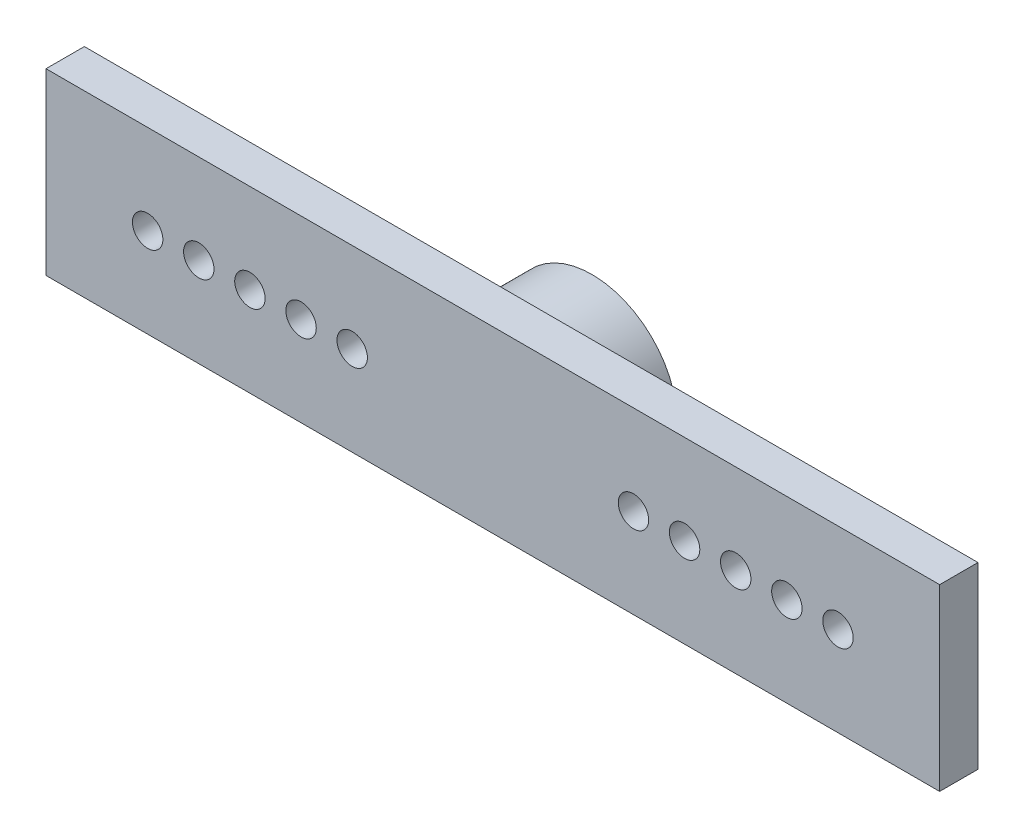
ISO-10303-21;
HEADER;
FILE_DESCRIPTION(('STEP AP214'),'2;1');
FILE_NAME('part.step','',(''),(''),'','','');
FILE_SCHEMA(('AUTOMOTIVE_DESIGN { 1 0 10303 214 1 1 1 1 }'));
ENDSEC;
DATA;
#1=APPLICATION_CONTEXT('core data for automotive mechanical design processes');
#2=APPLICATION_PROTOCOL_DEFINITION('international standard','automotive_design',2000,#1);
#3=PRODUCT_CONTEXT('',#1,'mechanical');
#4=PRODUCT('Part','Part','',(#3));
#5=PRODUCT_RELATED_PRODUCT_CATEGORY('part','',(#4));
#6=PRODUCT_DEFINITION_FORMATION('','',#4);
#7=PRODUCT_DEFINITION_CONTEXT('part definition',#1,'design');
#8=PRODUCT_DEFINITION('design','',#6,#7);
#9=PRODUCT_DEFINITION_SHAPE('','',#8);
#10=(LENGTH_UNIT() NAMED_UNIT(*) SI_UNIT(.MILLI.,.METRE.));
#11=(NAMED_UNIT(*) PLANE_ANGLE_UNIT() SI_UNIT($,.RADIAN.));
#12=(NAMED_UNIT(*) SI_UNIT($,.STERADIAN.) SOLID_ANGLE_UNIT());
#13=UNCERTAINTY_MEASURE_WITH_UNIT(LENGTH_MEASURE(1.E-05),#10,'distance_accuracy_value','');
#14=(GEOMETRIC_REPRESENTATION_CONTEXT(3) GLOBAL_UNCERTAINTY_ASSIGNED_CONTEXT((#13)) GLOBAL_UNIT_ASSIGNED_CONTEXT((#10,
#11,#12)) REPRESENTATION_CONTEXT('',''));
#15=CARTESIAN_POINT('',(0.,0.,0.));
#16=DIRECTION('',(0.,0.,1.));
#17=DIRECTION('',(1.,0.,0.));
#18=AXIS2_PLACEMENT_3D('',#15,#16,#17);
#19=CARTESIAN_POINT('',(22.1938363345951,4.44784573033217,0.));
#20=DIRECTION('',(0.,0.,-1.));
#21=DIRECTION('',(-1.,0.,0.));
#22=AXIS2_PLACEMENT_3D('',#19,#20,#21);
#23=PLANE('',#22);
#24=CARTESIAN_POINT('',(-17.145,-1.19722964452441E-13,0.));
#25=DIRECTION('',(0.,0.,-1.));
#26=DIRECTION('',(-1.,0.,0.));
#27=AXIS2_PLACEMENT_3D('',#24,#25,#26);
#28=CIRCLE('',#27,0.75565);
#29=CARTESIAN_POINT('',(-17.90065,-1.19722964452441E-13,0.));
#30=VERTEX_POINT('',#29);
#31=EDGE_CURVE('E184',#30,#30,#28,.T.);
#32=ORIENTED_EDGE('',*,*,#31,.F.);
#33=EDGE_LOOP('',(#32));
#34=FACE_BOUND('',#33,.T.);
#35=CARTESIAN_POINT('',(-14.605,-1.01986228978005E-13,0.));
#36=DIRECTION('',(0.,0.,-1.));
#37=DIRECTION('',(-1.,0.,0.));
#38=AXIS2_PLACEMENT_3D('',#35,#36,#37);
#39=CIRCLE('',#38,0.755649999999999);
#40=CARTESIAN_POINT('',(-15.36065,-1.01986228978005E-13,0.));
#41=VERTEX_POINT('',#40);
#42=EDGE_CURVE('E178',#41,#41,#39,.T.);
#43=ORIENTED_EDGE('',*,*,#42,.F.);
#44=EDGE_LOOP('',(#43));
#45=FACE_BOUND('',#44,.T.);
#46=CARTESIAN_POINT('',(-12.065,0.,0.));
#47=DIRECTION('',(0.,0.,-1.));
#48=DIRECTION('',(-1.,0.,0.));
#49=AXIS2_PLACEMENT_3D('',#46,#47,#48);
#50=CIRCLE('',#49,0.755649999999999);
#51=CARTESIAN_POINT('',(-12.82065,0.,0.));
#52=VERTEX_POINT('',#51);
#53=EDGE_CURVE('E172',#52,#52,#50,.T.);
#54=ORIENTED_EDGE('',*,*,#53,.F.);
#55=EDGE_LOOP('',(#54));
#56=FACE_BOUND('',#55,.T.);
#57=CARTESIAN_POINT('',(-9.525,0.,0.));
#58=DIRECTION('',(0.,0.,-1.));
#59=DIRECTION('',(-1.,0.,0.));
#60=AXIS2_PLACEMENT_3D('',#57,#58,#59);
#61=CIRCLE('',#60,0.755649999999999);
#62=CARTESIAN_POINT('',(-10.28065,0.,0.));
#63=VERTEX_POINT('',#62);
#64=EDGE_CURVE('E166',#63,#63,#61,.T.);
#65=ORIENTED_EDGE('',*,*,#64,.F.);
#66=EDGE_LOOP('',(#65));
#67=FACE_BOUND('',#66,.T.);
#68=CARTESIAN_POINT('',(-6.985,0.,0.));
#69=DIRECTION('',(0.,0.,-1.));
#70=DIRECTION('',(-1.,0.,0.));
#71=AXIS2_PLACEMENT_3D('',#68,#69,#70);
#72=CIRCLE('',#71,0.755649999999999);
#73=CARTESIAN_POINT('',(-7.74065,0.,0.));
#74=VERTEX_POINT('',#73);
#75=EDGE_CURVE('E160',#74,#74,#72,.T.);
#76=ORIENTED_EDGE('',*,*,#75,.F.);
#77=EDGE_LOOP('',(#76));
#78=FACE_BOUND('',#77,.T.);
#79=CARTESIAN_POINT('',(17.145,0.,0.));
#80=DIRECTION('',(0.,0.,-1.));
#81=DIRECTION('',(-1.,0.,0.));
#82=AXIS2_PLACEMENT_3D('',#79,#80,#81);
#83=CIRCLE('',#82,0.75565);
#84=CARTESIAN_POINT('',(16.38935,0.,0.));
#85=VERTEX_POINT('',#84);
#86=EDGE_CURVE('E154',#85,#85,#83,.T.);
#87=ORIENTED_EDGE('',*,*,#86,.F.);
#88=EDGE_LOOP('',(#87));
#89=FACE_BOUND('',#88,.T.);
#90=CARTESIAN_POINT('',(14.605,0.,0.));
#91=DIRECTION('',(0.,0.,-1.));
#92=DIRECTION('',(-1.,0.,0.));
#93=AXIS2_PLACEMENT_3D('',#90,#91,#92);
#94=CIRCLE('',#93,0.755649999999999);
#95=CARTESIAN_POINT('',(13.84935,0.,0.));
#96=VERTEX_POINT('',#95);
#97=EDGE_CURVE('E148',#96,#96,#94,.T.);
#98=ORIENTED_EDGE('',*,*,#97,.F.);
#99=EDGE_LOOP('',(#98));
#100=FACE_BOUND('',#99,.T.);
#101=CARTESIAN_POINT('',(12.065,0.,0.));
#102=DIRECTION('',(0.,0.,-1.));
#103=DIRECTION('',(-1.,0.,0.));
#104=AXIS2_PLACEMENT_3D('',#101,#102,#103);
#105=CIRCLE('',#104,0.755649999999999);
#106=CARTESIAN_POINT('',(11.30935,0.,0.));
#107=VERTEX_POINT('',#106);
#108=EDGE_CURVE('E142',#107,#107,#105,.T.);
#109=ORIENTED_EDGE('',*,*,#108,.F.);
#110=EDGE_LOOP('',(#109));
#111=FACE_BOUND('',#110,.T.);
#112=CARTESIAN_POINT('',(9.525,0.,0.));
#113=DIRECTION('',(0.,0.,-1.));
#114=DIRECTION('',(-1.,0.,0.));
#115=AXIS2_PLACEMENT_3D('',#112,#113,#114);
#116=CIRCLE('',#115,0.755649999999999);
#117=CARTESIAN_POINT('',(8.76935,0.,0.));
#118=VERTEX_POINT('',#117);
#119=EDGE_CURVE('E136',#118,#118,#116,.T.);
#120=ORIENTED_EDGE('',*,*,#119,.F.);
#121=EDGE_LOOP('',(#120));
#122=FACE_BOUND('',#121,.T.);
#123=CARTESIAN_POINT('',(6.985,0.,0.));
#124=DIRECTION('',(0.,0.,-1.));
#125=DIRECTION('',(-1.,0.,0.));
#126=AXIS2_PLACEMENT_3D('',#123,#124,#125);
#127=CIRCLE('',#126,0.755649999999999);
#128=CARTESIAN_POINT('',(6.22935,0.,0.));
#129=VERTEX_POINT('',#128);
#130=EDGE_CURVE('E41',#129,#129,#127,.T.);
#131=ORIENTED_EDGE('',*,*,#130,.F.);
#132=EDGE_LOOP('',(#131));
#133=FACE_BOUND('',#132,.T.);
#134=DIRECTION('',(0.,1.,0.));
#135=VECTOR('',#134,1.);
#136=CARTESIAN_POINT('',(22.1938363345951,-4.44784573033217,0.));
#137=LINE('',#136,#135);
#138=CARTESIAN_POINT('',(22.1938363345951,-4.44784573033217,0.));
#139=VERTEX_POINT('',#138);
#140=CARTESIAN_POINT('',(22.1938363345951,4.44784573033217,0.));
#141=VERTEX_POINT('',#140);
#142=EDGE_CURVE('E105',#139,#141,#137,.T.);
#143=ORIENTED_EDGE('',*,*,#142,.F.);
#144=DIRECTION('',(1.,0.,0.));
#145=VECTOR('',#144,1.);
#146=CARTESIAN_POINT('',(-22.1938363345951,-4.44784573033217,0.));
#147=LINE('',#146,#145);
#148=CARTESIAN_POINT('',(-22.1938363345951,-4.44784573033217,0.));
#149=VERTEX_POINT('',#148);
#150=EDGE_CURVE('E78',#149,#139,#147,.T.);
#151=ORIENTED_EDGE('',*,*,#150,.F.);
#152=DIRECTION('',(0.,-1.,0.));
#153=VECTOR('',#152,1.);
#154=CARTESIAN_POINT('',(-22.1938363345951,-4.44784573033217,0.));
#155=LINE('',#154,#153);
#156=CARTESIAN_POINT('',(-22.1938363345951,4.44784573033217,0.));
#157=VERTEX_POINT('',#156);
#158=EDGE_CURVE('E72',#157,#149,#155,.T.);
#159=ORIENTED_EDGE('',*,*,#158,.F.);
#160=DIRECTION('',(-1.,0.,0.));
#161=VECTOR('',#160,1.);
#162=CARTESIAN_POINT('',(-22.1938363345951,4.44784573033217,0.));
#163=LINE('',#162,#161);
#164=EDGE_CURVE('E96',#141,#157,#163,.T.);
#165=ORIENTED_EDGE('',*,*,#164,.F.);
#166=EDGE_LOOP('',(#143,#151,#159,#165));
#167=FACE_BOUND('',#166,.T.);
#168=CARTESIAN_POINT('',(0.,0.,0.));
#169=DIRECTION('',(0.,0.,-1.));
#170=DIRECTION('',(-1.,0.,0.));
#171=AXIS2_PLACEMENT_3D('',#168,#169,#170);
#172=CIRCLE('',#171,4.2291);
#173=CARTESIAN_POINT('',(-4.2291,0.,0.));
#174=VERTEX_POINT('',#173);
#175=EDGE_CURVE('E124',#174,#174,#172,.T.);
#176=ORIENTED_EDGE('',*,*,#175,.F.);
#177=EDGE_LOOP('',(#176));
#178=FACE_BOUND('',#177,.T.);
#179=ADVANCED_FACE('F37',(#34,#45,#56,#67,#78,#89,#100,#111,#122,#133,#167,#178),#23,.T.);
#180=CARTESIAN_POINT('',(22.1938363345951,-4.44784573033217,1.905));
#181=DIRECTION('',(-1.,0.,0.));
#182=DIRECTION('',(0.,0.,1.));
#183=AXIS2_PLACEMENT_3D('',#180,#181,#182);
#184=PLANE('',#183);
#185=ORIENTED_EDGE('',*,*,#142,.T.);
#186=DIRECTION('',(0.,0.,-1.));
#187=VECTOR('',#186,1.);
#188=CARTESIAN_POINT('',(22.1938363345951,4.44784573033217,1.905));
#189=LINE('',#188,#187);
#190=CARTESIAN_POINT('',(22.1938363345951,4.44784573033217,1.905));
#191=VERTEX_POINT('',#190);
#192=EDGE_CURVE('E47',#191,#141,#189,.T.);
#193=ORIENTED_EDGE('',*,*,#192,.F.);
#194=DIRECTION('',(0.,1.,0.));
#195=VECTOR('',#194,1.);
#196=CARTESIAN_POINT('',(22.1938363345951,-4.44784573033217,1.905));
#197=LINE('',#196,#195);
#198=CARTESIAN_POINT('',(22.1938363345951,-4.44784573033217,1.905));
#199=VERTEX_POINT('',#198);
#200=EDGE_CURVE('E91',#199,#191,#197,.T.);
#201=ORIENTED_EDGE('',*,*,#200,.F.);
#202=DIRECTION('',(0.,0.,-1.));
#203=VECTOR('',#202,1.);
#204=CARTESIAN_POINT('',(22.1938363345951,-4.44784573033217,1.905));
#205=LINE('',#204,#203);
#206=EDGE_CURVE('E101',#199,#139,#205,.T.);
#207=ORIENTED_EDGE('',*,*,#206,.T.);
#208=EDGE_LOOP('',(#185,#193,#201,#207));
#209=FACE_BOUND('',#208,.T.);
#210=ADVANCED_FACE('F39',(#209),#184,.F.);
#211=CARTESIAN_POINT('',(-22.1938363345951,4.44784573033217,1.905));
#212=DIRECTION('',(0.,-1.,0.));
#213=DIRECTION('',(0.,0.,-1.));
#214=AXIS2_PLACEMENT_3D('',#211,#212,#213);
#215=PLANE('',#214);
#216=ORIENTED_EDGE('',*,*,#164,.T.);
#217=DIRECTION('',(0.,0.,-1.));
#218=VECTOR('',#217,1.);
#219=CARTESIAN_POINT('',(-22.1938363345951,4.44784573033217,1.905));
#220=LINE('',#219,#218);
#221=CARTESIAN_POINT('',(-22.1938363345951,4.44784573033217,1.905));
#222=VERTEX_POINT('',#221);
#223=EDGE_CURVE('E94',#222,#157,#220,.T.);
#224=ORIENTED_EDGE('',*,*,#223,.F.);
#225=DIRECTION('',(-1.,0.,0.));
#226=VECTOR('',#225,1.);
#227=CARTESIAN_POINT('',(-22.1938363345951,4.44784573033217,1.905));
#228=LINE('',#227,#226);
#229=EDGE_CURVE('E86',#191,#222,#228,.T.);
#230=ORIENTED_EDGE('',*,*,#229,.F.);
#231=ORIENTED_EDGE('',*,*,#192,.T.);
#232=EDGE_LOOP('',(#216,#224,#230,#231));
#233=FACE_BOUND('',#232,.T.);
#234=ADVANCED_FACE('F95',(#233),#215,.F.);
#235=CARTESIAN_POINT('',(-22.1938363345951,-4.44784573033217,1.905));
#236=DIRECTION('',(1.,0.,0.));
#237=DIRECTION('',(0.,0.,-1.));
#238=AXIS2_PLACEMENT_3D('',#235,#236,#237);
#239=PLANE('',#238);
#240=ORIENTED_EDGE('',*,*,#158,.T.);
#241=DIRECTION('',(0.,0.,-1.));
#242=VECTOR('',#241,1.);
#243=CARTESIAN_POINT('',(-22.1938363345951,-4.44784573033217,1.905));
#244=LINE('',#243,#242);
#245=CARTESIAN_POINT('',(-22.1938363345951,-4.44784573033217,1.905));
#246=VERTEX_POINT('',#245);
#247=EDGE_CURVE('E97',#246,#149,#244,.T.);
#248=ORIENTED_EDGE('',*,*,#247,.F.);
#249=DIRECTION('',(0.,-1.,0.));
#250=VECTOR('',#249,1.);
#251=CARTESIAN_POINT('',(-22.1938363345951,-4.44784573033217,1.905));
#252=LINE('',#251,#250);
#253=EDGE_CURVE('E89',#222,#246,#252,.T.);
#254=ORIENTED_EDGE('',*,*,#253,.F.);
#255=ORIENTED_EDGE('',*,*,#223,.T.);
#256=EDGE_LOOP('',(#240,#248,#254,#255));
#257=FACE_BOUND('',#256,.T.);
#258=ADVANCED_FACE('F99',(#257),#239,.F.);
#259=CARTESIAN_POINT('',(-22.1938363345951,-4.44784573033217,1.905));
#260=DIRECTION('',(0.,1.,0.));
#261=DIRECTION('',(0.,0.,1.));
#262=AXIS2_PLACEMENT_3D('',#259,#260,#261);
#263=PLANE('',#262);
#264=ORIENTED_EDGE('',*,*,#150,.T.);
#265=ORIENTED_EDGE('',*,*,#206,.F.);
#266=DIRECTION('',(1.,0.,0.));
#267=VECTOR('',#266,1.);
#268=CARTESIAN_POINT('',(-22.1938363345951,-4.44784573033217,1.905));
#269=LINE('',#268,#267);
#270=EDGE_CURVE('E55',#246,#199,#269,.T.);
#271=ORIENTED_EDGE('',*,*,#270,.F.);
#272=ORIENTED_EDGE('',*,*,#247,.T.);
#273=EDGE_LOOP('',(#264,#265,#271,#272));
#274=FACE_BOUND('',#273,.T.);
#275=ADVANCED_FACE('F196',(#274),#263,.F.);
#276=CARTESIAN_POINT('',(22.1938363345951,4.44784573033217,1.905));
#277=DIRECTION('',(0.,0.,-1.));
#278=DIRECTION('',(-1.,0.,0.));
#279=AXIS2_PLACEMENT_3D('',#276,#277,#278);
#280=PLANE('',#279);
#281=CARTESIAN_POINT('',(-17.145,-1.19722964452441E-13,1.905));
#282=DIRECTION('',(0.,0.,1.));
#283=DIRECTION('',(1.,0.,0.));
#284=AXIS2_PLACEMENT_3D('',#281,#282,#283);
#285=CIRCLE('',#284,0.75565);
#286=CARTESIAN_POINT('',(-16.38935,-1.19722964452441E-13,1.905));
#287=VERTEX_POINT('',#286);
#288=EDGE_CURVE('E187',#287,#287,#285,.T.);
#289=ORIENTED_EDGE('',*,*,#288,.F.);
#290=EDGE_LOOP('',(#289));
#291=FACE_BOUND('',#290,.T.);
#292=CARTESIAN_POINT('',(-14.605,-1.01986228978005E-13,1.905));
#293=DIRECTION('',(0.,0.,1.));
#294=DIRECTION('',(1.,0.,0.));
#295=AXIS2_PLACEMENT_3D('',#292,#293,#294);
#296=CIRCLE('',#295,0.75565);
#297=CARTESIAN_POINT('',(-13.84935,-1.01986228978005E-13,1.905));
#298=VERTEX_POINT('',#297);
#299=EDGE_CURVE('E181',#298,#298,#296,.T.);
#300=ORIENTED_EDGE('',*,*,#299,.F.);
#301=EDGE_LOOP('',(#300));
#302=FACE_BOUND('',#301,.T.);
#303=CARTESIAN_POINT('',(-12.065,0.,1.905));
#304=DIRECTION('',(0.,0.,1.));
#305=DIRECTION('',(1.,0.,0.));
#306=AXIS2_PLACEMENT_3D('',#303,#304,#305);
#307=CIRCLE('',#306,0.75565);
#308=CARTESIAN_POINT('',(-11.30935,0.,1.905));
#309=VERTEX_POINT('',#308);
#310=EDGE_CURVE('E175',#309,#309,#307,.T.);
#311=ORIENTED_EDGE('',*,*,#310,.F.);
#312=EDGE_LOOP('',(#311));
#313=FACE_BOUND('',#312,.T.);
#314=CARTESIAN_POINT('',(-9.525,0.,1.905));
#315=DIRECTION('',(0.,0.,1.));
#316=DIRECTION('',(1.,0.,0.));
#317=AXIS2_PLACEMENT_3D('',#314,#315,#316);
#318=CIRCLE('',#317,0.75565);
#319=CARTESIAN_POINT('',(-8.76935,0.,1.905));
#320=VERTEX_POINT('',#319);
#321=EDGE_CURVE('E169',#320,#320,#318,.T.);
#322=ORIENTED_EDGE('',*,*,#321,.F.);
#323=EDGE_LOOP('',(#322));
#324=FACE_BOUND('',#323,.T.);
#325=CARTESIAN_POINT('',(-6.985,0.,1.905));
#326=DIRECTION('',(0.,0.,1.));
#327=DIRECTION('',(1.,0.,0.));
#328=AXIS2_PLACEMENT_3D('',#325,#326,#327);
#329=CIRCLE('',#328,0.755649999999999);
#330=CARTESIAN_POINT('',(-6.22935,0.,1.905));
#331=VERTEX_POINT('',#330);
#332=EDGE_CURVE('E163',#331,#331,#329,.T.);
#333=ORIENTED_EDGE('',*,*,#332,.F.);
#334=EDGE_LOOP('',(#333));
#335=FACE_BOUND('',#334,.T.);
#336=CARTESIAN_POINT('',(17.145,0.,1.905));
#337=DIRECTION('',(0.,0.,1.));
#338=DIRECTION('',(1.,0.,0.));
#339=AXIS2_PLACEMENT_3D('',#336,#337,#338);
#340=CIRCLE('',#339,0.75565);
#341=CARTESIAN_POINT('',(17.90065,0.,1.905));
#342=VERTEX_POINT('',#341);
#343=EDGE_CURVE('E157',#342,#342,#340,.T.);
#344=ORIENTED_EDGE('',*,*,#343,.F.);
#345=EDGE_LOOP('',(#344));
#346=FACE_BOUND('',#345,.T.);
#347=CARTESIAN_POINT('',(14.605,0.,1.905));
#348=DIRECTION('',(0.,0.,1.));
#349=DIRECTION('',(1.,0.,0.));
#350=AXIS2_PLACEMENT_3D('',#347,#348,#349);
#351=CIRCLE('',#350,0.75565);
#352=CARTESIAN_POINT('',(15.36065,0.,1.905));
#353=VERTEX_POINT('',#352);
#354=EDGE_CURVE('E151',#353,#353,#351,.T.);
#355=ORIENTED_EDGE('',*,*,#354,.F.);
#356=EDGE_LOOP('',(#355));
#357=FACE_BOUND('',#356,.T.);
#358=CARTESIAN_POINT('',(12.065,0.,1.905));
#359=DIRECTION('',(0.,0.,1.));
#360=DIRECTION('',(1.,0.,0.));
#361=AXIS2_PLACEMENT_3D('',#358,#359,#360);
#362=CIRCLE('',#361,0.75565);
#363=CARTESIAN_POINT('',(12.82065,0.,1.905));
#364=VERTEX_POINT('',#363);
#365=EDGE_CURVE('E145',#364,#364,#362,.T.);
#366=ORIENTED_EDGE('',*,*,#365,.F.);
#367=EDGE_LOOP('',(#366));
#368=FACE_BOUND('',#367,.T.);
#369=CARTESIAN_POINT('',(9.525,0.,1.905));
#370=DIRECTION('',(0.,0.,1.));
#371=DIRECTION('',(1.,0.,0.));
#372=AXIS2_PLACEMENT_3D('',#369,#370,#371);
#373=CIRCLE('',#372,0.75565);
#374=CARTESIAN_POINT('',(10.28065,0.,1.905));
#375=VERTEX_POINT('',#374);
#376=EDGE_CURVE('E139',#375,#375,#373,.T.);
#377=ORIENTED_EDGE('',*,*,#376,.F.);
#378=EDGE_LOOP('',(#377));
#379=FACE_BOUND('',#378,.T.);
#380=CARTESIAN_POINT('',(6.985,0.,1.905));
#381=DIRECTION('',(0.,0.,1.));
#382=DIRECTION('',(1.,0.,0.));
#383=AXIS2_PLACEMENT_3D('',#380,#381,#382);
#384=CIRCLE('',#383,0.755649999999999);
#385=CARTESIAN_POINT('',(7.74065,0.,1.905));
#386=VERTEX_POINT('',#385);
#387=EDGE_CURVE('E133',#386,#386,#384,.T.);
#388=ORIENTED_EDGE('',*,*,#387,.F.);
#389=EDGE_LOOP('',(#388));
#390=FACE_BOUND('',#389,.T.);
#391=ORIENTED_EDGE('',*,*,#200,.T.);
#392=ORIENTED_EDGE('',*,*,#229,.T.);
#393=ORIENTED_EDGE('',*,*,#253,.T.);
#394=ORIENTED_EDGE('',*,*,#270,.T.);
#395=EDGE_LOOP('',(#391,#392,#393,#394));
#396=FACE_BOUND('',#395,.T.);
#397=ADVANCED_FACE('F87',(#291,#302,#313,#324,#335,#346,#357,#368,#379,#390,#396),#280,.F.);
#398=CARTESIAN_POINT('',(0.,0.,-3.0226));
#399=DIRECTION('',(0.,0.,-1.));
#400=DIRECTION('',(-1.,0.,0.));
#401=AXIS2_PLACEMENT_3D('',#398,#399,#400);
#402=PLANE('',#401);
#403=CARTESIAN_POINT('',(0.,0.,-3.0226));
#404=DIRECTION('',(0.,0.,-1.));
#405=DIRECTION('',(-1.,0.,0.));
#406=AXIS2_PLACEMENT_3D('',#403,#404,#405);
#407=CIRCLE('',#406,4.2291);
#408=CARTESIAN_POINT('',(-4.2291,0.,-3.0226));
#409=VERTEX_POINT('',#408);
#410=EDGE_CURVE('E108',#409,#409,#407,.T.);
#411=ORIENTED_EDGE('',*,*,#410,.T.);
#412=EDGE_LOOP('',(#411));
#413=FACE_BOUND('',#412,.T.);
#414=CARTESIAN_POINT('',(0.,0.,-3.0226));
#415=DIRECTION('',(0.,0.,-1.));
#416=DIRECTION('',(-1.,0.,0.));
#417=AXIS2_PLACEMENT_3D('',#414,#415,#416);
#418=CIRCLE('',#417,2.9718);
#419=CARTESIAN_POINT('',(-2.9718,0.,-3.0226));
#420=VERTEX_POINT('',#419);
#421=EDGE_CURVE('E126',#420,#420,#418,.T.);
#422=ORIENTED_EDGE('',*,*,#421,.F.);
#423=EDGE_LOOP('',(#422));
#424=FACE_BOUND('',#423,.T.);
#425=ADVANCED_FACE('F195',(#413,#424),#402,.T.);
#426=CARTESIAN_POINT('',(0.,0.,-3.0226));
#427=DIRECTION('',(0.,0.,1.));
#428=DIRECTION('',(1.,0.,0.));
#429=AXIS2_PLACEMENT_3D('',#426,#427,#428);
#430=CYLINDRICAL_SURFACE('',#429,4.2291);
#431=ORIENTED_EDGE('',*,*,#410,.F.);
#432=EDGE_LOOP('',(#431));
#433=FACE_BOUND('',#432,.T.);
#434=ORIENTED_EDGE('',*,*,#175,.T.);
#435=EDGE_LOOP('',(#434));
#436=FACE_BOUND('',#435,.T.);
#437=ADVANCED_FACE('F235',(#433,#436),#430,.T.);
#438=CARTESIAN_POINT('',(0.,0.,-3.0226));
#439=DIRECTION('',(0.,0.,1.));
#440=DIRECTION('',(1.,0.,0.));
#441=AXIS2_PLACEMENT_3D('',#438,#439,#440);
#442=CYLINDRICAL_SURFACE('',#441,2.9718);
#443=ORIENTED_EDGE('',*,*,#421,.T.);
#444=EDGE_LOOP('',(#443));
#445=FACE_BOUND('',#444,.T.);
#446=CARTESIAN_POINT('',(0.,0.,0.));
#447=DIRECTION('',(0.,0.,-1.));
#448=DIRECTION('',(-1.,0.,0.));
#449=AXIS2_PLACEMENT_3D('',#446,#447,#448);
#450=CIRCLE('',#449,2.9718);
#451=CARTESIAN_POINT('',(-2.9718,0.,0.));
#452=VERTEX_POINT('',#451);
#453=EDGE_CURVE('E11',#452,#452,#450,.F.);
#454=ORIENTED_EDGE('',*,*,#453,.T.);
#455=EDGE_LOOP('',(#454));
#456=FACE_BOUND('',#455,.T.);
#457=ADVANCED_FACE('F228',(#445,#456),#442,.F.);
#458=ORIENTED_EDGE('',*,*,#453,.F.);
#459=EDGE_LOOP('',(#458));
#460=FACE_BOUND('',#459,.T.);
#461=ADVANCED_FACE('F121',(#460),#23,.T.);
#462=CARTESIAN_POINT('',(6.985,0.,1.905));
#463=DIRECTION('',(0.,0.,1.));
#464=DIRECTION('',(1.,0.,0.));
#465=AXIS2_PLACEMENT_3D('',#462,#463,#464);
#466=CYLINDRICAL_SURFACE('',#465,0.755649999999999);
#467=ORIENTED_EDGE('',*,*,#130,.T.);
#468=EDGE_LOOP('',(#467));
#469=FACE_BOUND('',#468,.T.);
#470=ORIENTED_EDGE('',*,*,#387,.T.);
#471=EDGE_LOOP('',(#470));
#472=FACE_BOUND('',#471,.T.);
#473=ADVANCED_FACE('F216',(#469,#472),#466,.F.);
#474=CARTESIAN_POINT('',(9.525,0.,1.905));
#475=DIRECTION('',(0.,0.,1.));
#476=DIRECTION('',(1.,0.,0.));
#477=AXIS2_PLACEMENT_3D('',#474,#475,#476);
#478=CYLINDRICAL_SURFACE('',#477,0.755649999999999);
#479=ORIENTED_EDGE('',*,*,#119,.T.);
#480=EDGE_LOOP('',(#479));
#481=FACE_BOUND('',#480,.T.);
#482=ORIENTED_EDGE('',*,*,#376,.T.);
#483=EDGE_LOOP('',(#482));
#484=FACE_BOUND('',#483,.T.);
#485=ADVANCED_FACE('F218',(#481,#484),#478,.F.);
#486=CARTESIAN_POINT('',(12.065,0.,1.905));
#487=DIRECTION('',(0.,0.,1.));
#488=DIRECTION('',(1.,0.,0.));
#489=AXIS2_PLACEMENT_3D('',#486,#487,#488);
#490=CYLINDRICAL_SURFACE('',#489,0.755649999999999);
#491=ORIENTED_EDGE('',*,*,#108,.T.);
#492=EDGE_LOOP('',(#491));
#493=FACE_BOUND('',#492,.T.);
#494=ORIENTED_EDGE('',*,*,#365,.T.);
#495=EDGE_LOOP('',(#494));
#496=FACE_BOUND('',#495,.T.);
#497=ADVANCED_FACE('F225',(#493,#496),#490,.F.);
#498=CARTESIAN_POINT('',(14.605,0.,1.905));
#499=DIRECTION('',(0.,0.,1.));
#500=DIRECTION('',(1.,0.,0.));
#501=AXIS2_PLACEMENT_3D('',#498,#499,#500);
#502=CYLINDRICAL_SURFACE('',#501,0.755649999999999);
#503=ORIENTED_EDGE('',*,*,#97,.T.);
#504=EDGE_LOOP('',(#503));
#505=FACE_BOUND('',#504,.T.);
#506=ORIENTED_EDGE('',*,*,#354,.T.);
#507=EDGE_LOOP('',(#506));
#508=FACE_BOUND('',#507,.T.);
#509=ADVANCED_FACE('F326',(#505,#508),#502,.F.);
#510=CARTESIAN_POINT('',(17.145,0.,1.905));
#511=DIRECTION('',(0.,0.,1.));
#512=DIRECTION('',(1.,0.,0.));
#513=AXIS2_PLACEMENT_3D('',#510,#511,#512);
#514=CYLINDRICAL_SURFACE('',#513,0.75565);
#515=ORIENTED_EDGE('',*,*,#86,.T.);
#516=EDGE_LOOP('',(#515));
#517=FACE_BOUND('',#516,.T.);
#518=ORIENTED_EDGE('',*,*,#343,.T.);
#519=EDGE_LOOP('',(#518));
#520=FACE_BOUND('',#519,.T.);
#521=ADVANCED_FACE('F264',(#517,#520),#514,.F.);
#522=CARTESIAN_POINT('',(-6.985,0.,1.905));
#523=DIRECTION('',(0.,0.,1.));
#524=DIRECTION('',(1.,0.,0.));
#525=AXIS2_PLACEMENT_3D('',#522,#523,#524);
#526=CYLINDRICAL_SURFACE('',#525,0.755649999999999);
#527=ORIENTED_EDGE('',*,*,#75,.T.);
#528=EDGE_LOOP('',(#527));
#529=FACE_BOUND('',#528,.T.);
#530=ORIENTED_EDGE('',*,*,#332,.T.);
#531=EDGE_LOOP('',(#530));
#532=FACE_BOUND('',#531,.T.);
#533=ADVANCED_FACE('F276',(#529,#532),#526,.F.);
#534=CARTESIAN_POINT('',(-9.525,0.,1.905));
#535=DIRECTION('',(0.,0.,1.));
#536=DIRECTION('',(1.,0.,0.));
#537=AXIS2_PLACEMENT_3D('',#534,#535,#536);
#538=CYLINDRICAL_SURFACE('',#537,0.755649999999999);
#539=ORIENTED_EDGE('',*,*,#64,.T.);
#540=EDGE_LOOP('',(#539));
#541=FACE_BOUND('',#540,.T.);
#542=ORIENTED_EDGE('',*,*,#321,.T.);
#543=EDGE_LOOP('',(#542));
#544=FACE_BOUND('',#543,.T.);
#545=ADVANCED_FACE('F281',(#541,#544),#538,.F.);
#546=CARTESIAN_POINT('',(-12.065,0.,1.905));
#547=DIRECTION('',(0.,0.,1.));
#548=DIRECTION('',(1.,0.,0.));
#549=AXIS2_PLACEMENT_3D('',#546,#547,#548);
#550=CYLINDRICAL_SURFACE('',#549,0.755649999999999);
#551=ORIENTED_EDGE('',*,*,#53,.T.);
#552=EDGE_LOOP('',(#551));
#553=FACE_BOUND('',#552,.T.);
#554=ORIENTED_EDGE('',*,*,#310,.T.);
#555=EDGE_LOOP('',(#554));
#556=FACE_BOUND('',#555,.T.);
#557=ADVANCED_FACE('F291',(#553,#556),#550,.F.);
#558=CARTESIAN_POINT('',(-14.605,-1.01986228978005E-13,1.905));
#559=DIRECTION('',(0.,0.,1.));
#560=DIRECTION('',(1.,0.,0.));
#561=AXIS2_PLACEMENT_3D('',#558,#559,#560);
#562=CYLINDRICAL_SURFACE('',#561,0.755649999999999);
#563=ORIENTED_EDGE('',*,*,#42,.T.);
#564=EDGE_LOOP('',(#563));
#565=FACE_BOUND('',#564,.T.);
#566=ORIENTED_EDGE('',*,*,#299,.T.);
#567=EDGE_LOOP('',(#566));
#568=FACE_BOUND('',#567,.T.);
#569=ADVANCED_FACE('F301',(#565,#568),#562,.F.);
#570=CARTESIAN_POINT('',(-17.145,-1.19722964452441E-13,1.905));
#571=DIRECTION('',(0.,0.,1.));
#572=DIRECTION('',(1.,0.,0.));
#573=AXIS2_PLACEMENT_3D('',#570,#571,#572);
#574=CYLINDRICAL_SURFACE('',#573,0.75565);
#575=ORIENTED_EDGE('',*,*,#31,.T.);
#576=EDGE_LOOP('',(#575));
#577=FACE_BOUND('',#576,.T.);
#578=ORIENTED_EDGE('',*,*,#288,.T.);
#579=EDGE_LOOP('',(#578));
#580=FACE_BOUND('',#579,.T.);
#581=ADVANCED_FACE('F191',(#577,#580),#574,.F.);
#582=CLOSED_SHELL('',(#179,#210,#234,#258,#275,#397,#425,#437,#457,#461,#473,#485,#497,#509,
#521,#533,#545,#557,#569,#581));
#583=MANIFOLD_SOLID_BREP('B2',#582);
#584=ADVANCED_BREP_SHAPE_REPRESENTATION('',(#18,#583),#14);
#585=SHAPE_DEFINITION_REPRESENTATION(#9,#584);
ENDSEC;
END-ISO-10303-21;
